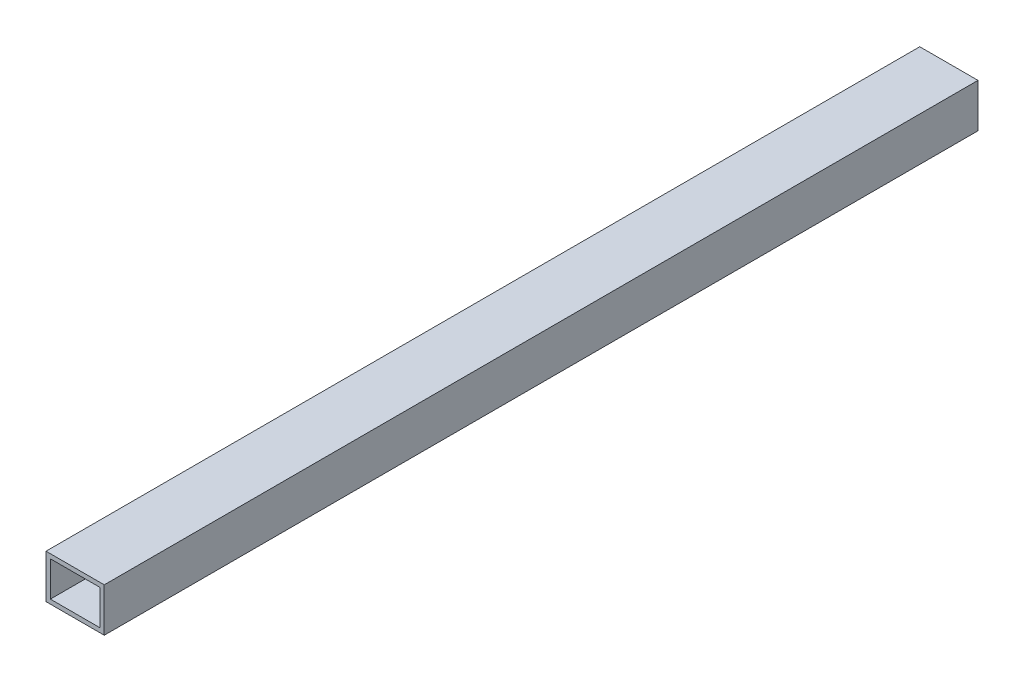
ISO-10303-21;
HEADER;
FILE_DESCRIPTION(('STEP AP214'),'2;1');
FILE_NAME('part.step','',(''),(''),'','','');
FILE_SCHEMA(('AUTOMOTIVE_DESIGN { 1 0 10303 214 1 1 1 1 }'));
ENDSEC;
DATA;
#1=APPLICATION_CONTEXT('core data for automotive mechanical design processes');
#2=APPLICATION_PROTOCOL_DEFINITION('international standard','automotive_design',2000,#1);
#3=PRODUCT_CONTEXT('',#1,'mechanical');
#4=PRODUCT('Part','Part','',(#3));
#5=PRODUCT_RELATED_PRODUCT_CATEGORY('part','',(#4));
#6=PRODUCT_DEFINITION_FORMATION('','',#4);
#7=PRODUCT_DEFINITION_CONTEXT('part definition',#1,'design');
#8=PRODUCT_DEFINITION('design','',#6,#7);
#9=PRODUCT_DEFINITION_SHAPE('','',#8);
#10=(LENGTH_UNIT() NAMED_UNIT(*) SI_UNIT(.MILLI.,.METRE.));
#11=(NAMED_UNIT(*) PLANE_ANGLE_UNIT() SI_UNIT($,.RADIAN.));
#12=(NAMED_UNIT(*) SI_UNIT($,.STERADIAN.) SOLID_ANGLE_UNIT());
#13=UNCERTAINTY_MEASURE_WITH_UNIT(LENGTH_MEASURE(1.E-05),#10,'distance_accuracy_value','');
#14=(GEOMETRIC_REPRESENTATION_CONTEXT(3) GLOBAL_UNCERTAINTY_ASSIGNED_CONTEXT((#13)) GLOBAL_UNIT_ASSIGNED_CONTEXT((#10,
#11,#12)) REPRESENTATION_CONTEXT('',''));
#15=CARTESIAN_POINT('',(0.,0.,0.));
#16=DIRECTION('',(0.,0.,1.));
#17=DIRECTION('',(1.,0.,0.));
#18=AXIS2_PLACEMENT_3D('',#15,#16,#17);
#19=CARTESIAN_POINT('',(40.,-15.,300.));
#20=DIRECTION('',(0.,1.,0.));
#21=DIRECTION('',(0.,0.,1.));
#22=AXIS2_PLACEMENT_3D('',#19,#20,#21);
#23=PLANE('',#22);
#24=DIRECTION('',(0.,0.,-1.));
#25=VECTOR('',#24,1.);
#26=CARTESIAN_POINT('',(0.,-15.,300.));
#27=LINE('',#26,#25);
#28=CARTESIAN_POINT('',(0.,-15.,300.));
#29=VERTEX_POINT('',#28);
#30=CARTESIAN_POINT('',(0.,-15.,-300.));
#31=VERTEX_POINT('',#30);
#32=EDGE_CURVE('E134',#29,#31,#27,.T.);
#33=ORIENTED_EDGE('',*,*,#32,.T.);
#34=DIRECTION('',(-1.,0.,0.));
#35=VECTOR('',#34,1.);
#36=CARTESIAN_POINT('',(40.,-15.,-300.));
#37=LINE('',#36,#35);
#38=CARTESIAN_POINT('',(40.,-15.,-300.));
#39=VERTEX_POINT('',#38);
#40=EDGE_CURVE('E11',#39,#31,#37,.T.);
#41=ORIENTED_EDGE('',*,*,#40,.F.);
#42=DIRECTION('',(0.,0.,-1.));
#43=VECTOR('',#42,1.);
#44=CARTESIAN_POINT('',(40.,-15.,300.));
#45=LINE('',#44,#43);
#46=CARTESIAN_POINT('',(40.,-15.,300.));
#47=VERTEX_POINT('',#46);
#48=EDGE_CURVE('E135',#47,#39,#45,.T.);
#49=ORIENTED_EDGE('',*,*,#48,.F.);
#50=DIRECTION('',(-1.,0.,0.));
#51=VECTOR('',#50,1.);
#52=CARTESIAN_POINT('',(40.,-15.,300.));
#53=LINE('',#52,#51);
#54=EDGE_CURVE('E145',#47,#29,#53,.T.);
#55=ORIENTED_EDGE('',*,*,#54,.T.);
#56=EDGE_LOOP('',(#33,#41,#49,#55));
#57=FACE_BOUND('',#56,.T.);
#58=ADVANCED_FACE('F33',(#57),#23,.F.);
#59=CARTESIAN_POINT('',(40.,-15.,-300.));
#60=DIRECTION('',(0.,0.,1.));
#61=DIRECTION('',(1.,0.,0.));
#62=AXIS2_PLACEMENT_3D('',#59,#60,#61);
#63=PLANE('',#62);
#64=DIRECTION('',(-1.,0.,0.));
#65=VECTOR('',#64,1.);
#66=CARTESIAN_POINT('',(40.,12.,-300.));
#67=LINE('',#66,#65);
#68=CARTESIAN_POINT('',(37.,12.,-300.));
#69=VERTEX_POINT('',#68);
#70=CARTESIAN_POINT('',(2.99999999999999,12.,-300.));
#71=VERTEX_POINT('',#70);
#72=EDGE_CURVE('E128',#69,#71,#67,.T.);
#73=ORIENTED_EDGE('',*,*,#72,.T.);
#74=DIRECTION('',(0.,-1.,0.));
#75=VECTOR('',#74,1.);
#76=CARTESIAN_POINT('',(3.,-15.,-300.));
#77=LINE('',#76,#75);
#78=CARTESIAN_POINT('',(3.,-12.,-300.));
#79=VERTEX_POINT('',#78);
#80=EDGE_CURVE('E131',#71,#79,#77,.T.);
#81=ORIENTED_EDGE('',*,*,#80,.T.);
#82=DIRECTION('',(1.,0.,0.));
#83=VECTOR('',#82,1.);
#84=CARTESIAN_POINT('',(40.,-12.,-300.));
#85=LINE('',#84,#83);
#86=CARTESIAN_POINT('',(37.,-12.,-300.));
#87=VERTEX_POINT('',#86);
#88=EDGE_CURVE('E123',#79,#87,#85,.T.);
#89=ORIENTED_EDGE('',*,*,#88,.T.);
#90=DIRECTION('',(0.,1.,0.));
#91=VECTOR('',#90,1.);
#92=CARTESIAN_POINT('',(37.,-15.,-300.));
#93=LINE('',#92,#91);
#94=EDGE_CURVE('E103',#87,#69,#93,.T.);
#95=ORIENTED_EDGE('',*,*,#94,.T.);
#96=EDGE_LOOP('',(#73,#81,#89,#95));
#97=FACE_BOUND('',#96,.T.);
#98=DIRECTION('',(0.,1.,0.));
#99=VECTOR('',#98,1.);
#100=CARTESIAN_POINT('',(0.,-15.,-300.));
#101=LINE('',#100,#99);
#102=CARTESIAN_POINT('',(0.,15.,-300.));
#103=VERTEX_POINT('',#102);
#104=EDGE_CURVE('E148',#31,#103,#101,.T.);
#105=ORIENTED_EDGE('',*,*,#104,.T.);
#106=DIRECTION('',(-1.,0.,0.));
#107=VECTOR('',#106,1.);
#108=CARTESIAN_POINT('',(40.,15.,-300.));
#109=LINE('',#108,#107);
#110=CARTESIAN_POINT('',(40.,15.,-300.));
#111=VERTEX_POINT('',#110);
#112=EDGE_CURVE('E40',#111,#103,#109,.T.);
#113=ORIENTED_EDGE('',*,*,#112,.F.);
#114=DIRECTION('',(0.,1.,0.));
#115=VECTOR('',#114,1.);
#116=CARTESIAN_POINT('',(40.,-15.,-300.));
#117=LINE('',#116,#115);
#118=EDGE_CURVE('E138',#39,#111,#117,.T.);
#119=ORIENTED_EDGE('',*,*,#118,.F.);
#120=ORIENTED_EDGE('',*,*,#40,.T.);
#121=EDGE_LOOP('',(#105,#113,#119,#120));
#122=FACE_BOUND('',#121,.T.);
#123=ADVANCED_FACE('F176',(#97,#122),#63,.F.);
#124=CARTESIAN_POINT('',(40.,15.,300.));
#125=DIRECTION('',(0.,-1.,0.));
#126=DIRECTION('',(0.,0.,-1.));
#127=AXIS2_PLACEMENT_3D('',#124,#125,#126);
#128=PLANE('',#127);
#129=DIRECTION('',(0.,0.,1.));
#130=VECTOR('',#129,1.);
#131=CARTESIAN_POINT('',(0.,15.,300.));
#132=LINE('',#131,#130);
#133=CARTESIAN_POINT('',(0.,15.,300.));
#134=VERTEX_POINT('',#133);
#135=EDGE_CURVE('E150',#103,#134,#132,.T.);
#136=ORIENTED_EDGE('',*,*,#135,.T.);
#137=DIRECTION('',(-1.,0.,0.));
#138=VECTOR('',#137,1.);
#139=CARTESIAN_POINT('',(40.,15.,300.));
#140=LINE('',#139,#138);
#141=CARTESIAN_POINT('',(40.,15.,300.));
#142=VERTEX_POINT('',#141);
#143=EDGE_CURVE('E155',#142,#134,#140,.T.);
#144=ORIENTED_EDGE('',*,*,#143,.F.);
#145=DIRECTION('',(0.,0.,1.));
#146=VECTOR('',#145,1.);
#147=CARTESIAN_POINT('',(40.,15.,300.));
#148=LINE('',#147,#146);
#149=EDGE_CURVE('E141',#111,#142,#148,.T.);
#150=ORIENTED_EDGE('',*,*,#149,.F.);
#151=ORIENTED_EDGE('',*,*,#112,.T.);
#152=EDGE_LOOP('',(#136,#144,#150,#151));
#153=FACE_BOUND('',#152,.T.);
#154=ADVANCED_FACE('F162',(#153),#128,.F.);
#155=CARTESIAN_POINT('',(40.,-15.,300.));
#156=DIRECTION('',(0.,0.,-1.));
#157=DIRECTION('',(-1.,0.,0.));
#158=AXIS2_PLACEMENT_3D('',#155,#156,#157);
#159=PLANE('',#158);
#160=DIRECTION('',(1.,0.,0.));
#161=VECTOR('',#160,1.);
#162=CARTESIAN_POINT('',(3.,-12.,300.));
#163=LINE('',#162,#161);
#164=CARTESIAN_POINT('',(3.,-12.,300.));
#165=VERTEX_POINT('',#164);
#166=CARTESIAN_POINT('',(37.,-12.,300.));
#167=VERTEX_POINT('',#166);
#168=EDGE_CURVE('E109',#165,#167,#163,.T.);
#169=ORIENTED_EDGE('',*,*,#168,.F.);
#170=DIRECTION('',(0.,-1.,0.));
#171=VECTOR('',#170,1.);
#172=CARTESIAN_POINT('',(3.,-12.,300.));
#173=LINE('',#172,#171);
#174=CARTESIAN_POINT('',(2.99999999999999,12.,300.));
#175=VERTEX_POINT('',#174);
#176=EDGE_CURVE('E55',#175,#165,#173,.T.);
#177=ORIENTED_EDGE('',*,*,#176,.F.);
#178=DIRECTION('',(-1.,0.,0.));
#179=VECTOR('',#178,1.);
#180=CARTESIAN_POINT('',(2.99999999999999,12.,300.));
#181=LINE('',#180,#179);
#182=CARTESIAN_POINT('',(37.,12.,300.));
#183=VERTEX_POINT('',#182);
#184=EDGE_CURVE('E116',#183,#175,#181,.T.);
#185=ORIENTED_EDGE('',*,*,#184,.F.);
#186=DIRECTION('',(0.,1.,0.));
#187=VECTOR('',#186,1.);
#188=CARTESIAN_POINT('',(37.,-12.,300.));
#189=LINE('',#188,#187);
#190=EDGE_CURVE('E100',#167,#183,#189,.T.);
#191=ORIENTED_EDGE('',*,*,#190,.F.);
#192=EDGE_LOOP('',(#169,#177,#185,#191));
#193=FACE_BOUND('',#192,.T.);
#194=DIRECTION('',(0.,-1.,0.));
#195=VECTOR('',#194,1.);
#196=CARTESIAN_POINT('',(0.,-15.,300.));
#197=LINE('',#196,#195);
#198=EDGE_CURVE('E139',#134,#29,#197,.T.);
#199=ORIENTED_EDGE('',*,*,#198,.T.);
#200=ORIENTED_EDGE('',*,*,#54,.F.);
#201=DIRECTION('',(0.,-1.,0.));
#202=VECTOR('',#201,1.);
#203=CARTESIAN_POINT('',(40.,-15.,300.));
#204=LINE('',#203,#202);
#205=EDGE_CURVE('E143',#142,#47,#204,.T.);
#206=ORIENTED_EDGE('',*,*,#205,.F.);
#207=ORIENTED_EDGE('',*,*,#143,.T.);
#208=EDGE_LOOP('',(#199,#200,#206,#207));
#209=FACE_BOUND('',#208,.T.);
#210=ADVANCED_FACE('F113',(#193,#209),#159,.F.);
#211=CARTESIAN_POINT('',(40.,0.,0.));
#212=DIRECTION('',(1.,0.,0.));
#213=DIRECTION('',(0.,0.,-1.));
#214=AXIS2_PLACEMENT_3D('',#211,#212,#213);
#215=PLANE('',#214);
#216=ORIENTED_EDGE('',*,*,#48,.T.);
#217=ORIENTED_EDGE('',*,*,#118,.T.);
#218=ORIENTED_EDGE('',*,*,#149,.T.);
#219=ORIENTED_EDGE('',*,*,#205,.T.);
#220=EDGE_LOOP('',(#216,#217,#218,#219));
#221=FACE_BOUND('',#220,.T.);
#222=ADVANCED_FACE('F175',(#221),#215,.T.);
#223=CARTESIAN_POINT('',(0.,0.,0.));
#224=DIRECTION('',(1.,0.,0.));
#225=DIRECTION('',(0.,0.,-1.));
#226=AXIS2_PLACEMENT_3D('',#223,#224,#225);
#227=PLANE('',#226);
#228=ORIENTED_EDGE('',*,*,#32,.F.);
#229=ORIENTED_EDGE('',*,*,#198,.F.);
#230=ORIENTED_EDGE('',*,*,#135,.F.);
#231=ORIENTED_EDGE('',*,*,#104,.F.);
#232=EDGE_LOOP('',(#228,#229,#230,#231));
#233=FACE_BOUND('',#232,.T.);
#234=ADVANCED_FACE('F168',(#233),#227,.F.);
#235=CARTESIAN_POINT('',(3.,-12.,-590.000000000001));
#236=DIRECTION('',(-1.,0.,0.));
#237=DIRECTION('',(0.,-1.,0.));
#238=AXIS2_PLACEMENT_3D('',#235,#236,#237);
#239=PLANE('',#238);
#240=DIRECTION('',(0.,0.,1.));
#241=VECTOR('',#240,1.);
#242=CARTESIAN_POINT('',(2.99999999999999,12.,-590.000000000001));
#243=LINE('',#242,#241);
#244=EDGE_CURVE('E121',#71,#175,#243,.T.);
#245=ORIENTED_EDGE('',*,*,#244,.T.);
#246=ORIENTED_EDGE('',*,*,#176,.T.);
#247=DIRECTION('',(0.,0.,1.));
#248=VECTOR('',#247,1.);
#249=CARTESIAN_POINT('',(3.,-12.,-590.000000000001));
#250=LINE('',#249,#248);
#251=EDGE_CURVE('E106',#79,#165,#250,.T.);
#252=ORIENTED_EDGE('',*,*,#251,.F.);
#253=ORIENTED_EDGE('',*,*,#80,.F.);
#254=EDGE_LOOP('',(#245,#246,#252,#253));
#255=FACE_BOUND('',#254,.T.);
#256=ADVANCED_FACE('F189',(#255),#239,.F.);
#257=CARTESIAN_POINT('',(2.99999999999999,12.,-590.000000000001));
#258=DIRECTION('',(0.,1.,0.));
#259=DIRECTION('',(0.,0.,1.));
#260=AXIS2_PLACEMENT_3D('',#257,#258,#259);
#261=PLANE('',#260);
#262=DIRECTION('',(0.,0.,1.));
#263=VECTOR('',#262,1.);
#264=CARTESIAN_POINT('',(37.,12.,-590.000000000001));
#265=LINE('',#264,#263);
#266=EDGE_CURVE('E105',#69,#183,#265,.T.);
#267=ORIENTED_EDGE('',*,*,#266,.T.);
#268=ORIENTED_EDGE('',*,*,#184,.T.);
#269=ORIENTED_EDGE('',*,*,#244,.F.);
#270=ORIENTED_EDGE('',*,*,#72,.F.);
#271=EDGE_LOOP('',(#267,#268,#269,#270));
#272=FACE_BOUND('',#271,.T.);
#273=ADVANCED_FACE('F194',(#272),#261,.F.);
#274=CARTESIAN_POINT('',(37.,-12.,-590.000000000001));
#275=DIRECTION('',(1.,0.,0.));
#276=DIRECTION('',(0.,1.,0.));
#277=AXIS2_PLACEMENT_3D('',#274,#275,#276);
#278=PLANE('',#277);
#279=DIRECTION('',(0.,0.,1.));
#280=VECTOR('',#279,1.);
#281=CARTESIAN_POINT('',(37.,-12.,-590.000000000001));
#282=LINE('',#281,#280);
#283=EDGE_CURVE('E47',#87,#167,#282,.T.);
#284=ORIENTED_EDGE('',*,*,#283,.T.);
#285=ORIENTED_EDGE('',*,*,#190,.T.);
#286=ORIENTED_EDGE('',*,*,#266,.F.);
#287=ORIENTED_EDGE('',*,*,#94,.F.);
#288=EDGE_LOOP('',(#284,#285,#286,#287));
#289=FACE_BOUND('',#288,.T.);
#290=ADVANCED_FACE('F97',(#289),#278,.F.);
#291=CARTESIAN_POINT('',(3.,-12.,-590.000000000001));
#292=DIRECTION('',(0.,-1.,0.));
#293=DIRECTION('',(0.,0.,-1.));
#294=AXIS2_PLACEMENT_3D('',#291,#292,#293);
#295=PLANE('',#294);
#296=ORIENTED_EDGE('',*,*,#251,.T.);
#297=ORIENTED_EDGE('',*,*,#168,.T.);
#298=ORIENTED_EDGE('',*,*,#283,.F.);
#299=ORIENTED_EDGE('',*,*,#88,.F.);
#300=EDGE_LOOP('',(#296,#297,#298,#299));
#301=FACE_BOUND('',#300,.T.);
#302=ADVANCED_FACE('F110',(#301),#295,.F.);
#303=CLOSED_SHELL('',(#58,#123,#154,#210,#222,#234,#256,#273,#290,#302));
#304=MANIFOLD_SOLID_BREP('B2',#303);
#305=ADVANCED_BREP_SHAPE_REPRESENTATION('',(#18,#304),#14);
#306=SHAPE_DEFINITION_REPRESENTATION(#9,#305);
ENDSEC;
END-ISO-10303-21;
